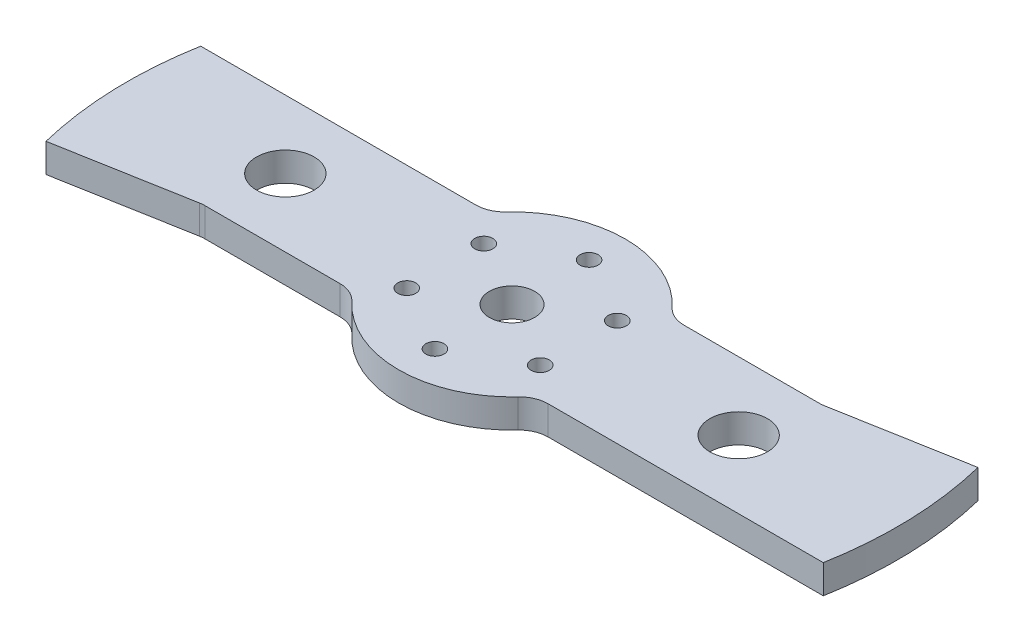
ISO-10303-21;
HEADER;
FILE_DESCRIPTION(('STEP AP214'),'2;1');
FILE_NAME('part.step','',(''),(''),'','','');
FILE_SCHEMA(('AUTOMOTIVE_DESIGN { 1 0 10303 214 1 1 1 1 }'));
ENDSEC;
DATA;
#1=APPLICATION_CONTEXT('core data for automotive mechanical design processes');
#2=APPLICATION_PROTOCOL_DEFINITION('international standard','automotive_design',2000,#1);
#3=PRODUCT_CONTEXT('',#1,'mechanical');
#4=PRODUCT('Part','Part','',(#3));
#5=PRODUCT_RELATED_PRODUCT_CATEGORY('part','',(#4));
#6=PRODUCT_DEFINITION_FORMATION('','',#4);
#7=PRODUCT_DEFINITION_CONTEXT('part definition',#1,'design');
#8=PRODUCT_DEFINITION('design','',#6,#7);
#9=PRODUCT_DEFINITION_SHAPE('','',#8);
#10=(LENGTH_UNIT() NAMED_UNIT(*) SI_UNIT(.MILLI.,.METRE.));
#11=(NAMED_UNIT(*) PLANE_ANGLE_UNIT() SI_UNIT($,.RADIAN.));
#12=(NAMED_UNIT(*) SI_UNIT($,.STERADIAN.) SOLID_ANGLE_UNIT());
#13=UNCERTAINTY_MEASURE_WITH_UNIT(LENGTH_MEASURE(1.E-05),#10,'distance_accuracy_value','');
#14=(GEOMETRIC_REPRESENTATION_CONTEXT(3) GLOBAL_UNCERTAINTY_ASSIGNED_CONTEXT((#13)) GLOBAL_UNIT_ASSIGNED_CONTEXT((#10,
#11,#12)) REPRESENTATION_CONTEXT('',''));
#15=CARTESIAN_POINT('',(0.,0.,0.));
#16=DIRECTION('',(0.,0.,1.));
#17=DIRECTION('',(1.,0.,0.));
#18=AXIS2_PLACEMENT_3D('',#15,#16,#17);
#19=CARTESIAN_POINT('',(0.,6.35,0.));
#20=DIRECTION('',(0.,-1.,0.));
#21=DIRECTION('',(0.,0.,-1.));
#22=AXIS2_PLACEMENT_3D('',#19,#20,#21);
#23=PLANE('',#22);
#24=CARTESIAN_POINT('',(-50.,6.35,0.));
#25=DIRECTION('',(0.,1.,0.));
#26=DIRECTION('',(0.,0.,1.));
#27=AXIS2_PLACEMENT_3D('',#24,#25,#26);
#28=CIRCLE('',#27,6.35);
#29=CARTESIAN_POINT('',(-50.,6.35,6.35000000000001));
#30=VERTEX_POINT('',#29);
#31=EDGE_CURVE('E574',#30,#30,#28,.T.);
#32=ORIENTED_EDGE('',*,*,#31,.F.);
#33=EDGE_LOOP('',(#32));
#34=FACE_BOUND('',#33,.T.);
#35=CARTESIAN_POINT('',(50.,6.35,0.));
#36=DIRECTION('',(0.,1.,0.));
#37=DIRECTION('',(0.,0.,1.));
#38=AXIS2_PLACEMENT_3D('',#35,#36,#37);
#39=CIRCLE('',#38,6.35);
#40=CARTESIAN_POINT('',(50.,6.35,6.35));
#41=VERTEX_POINT('',#40);
#42=EDGE_CURVE('E583',#41,#41,#39,.T.);
#43=ORIENTED_EDGE('',*,*,#42,.F.);
#44=EDGE_LOOP('',(#43));
#45=FACE_BOUND('',#44,.T.);
#46=CARTESIAN_POINT('',(0.,6.35,0.));
#47=DIRECTION('',(0.,1.,0.));
#48=DIRECTION('',(0.,0.,-1.));
#49=AXIS2_PLACEMENT_3D('',#46,#47,#48);
#50=CIRCLE('',#49,85.);
#51=CARTESIAN_POINT('',(-83.6660026534076,6.35,-15.));
#52=VERTEX_POINT('',#51);
#53=CARTESIAN_POINT('',(-82.5543913712341,6.35,20.2428373832601));
#54=VERTEX_POINT('',#53);
#55=EDGE_CURVE('E152',#52,#54,#50,.T.);
#56=ORIENTED_EDGE('',*,*,#55,.T.);
#57=DIRECTION('',(0.984305913569501,0.,-0.176470588235294));
#58=VECTOR('',#57,1.);
#59=CARTESIAN_POINT('',(-53.3112416099528,6.35,15.));
#60=LINE('',#59,#58);
#61=CARTESIAN_POINT('',(-53.8671043018561,6.35,15.0996574488337));
#62=VERTEX_POINT('',#61);
#63=EDGE_CURVE('E155',#54,#62,#60,.T.);
#64=ORIENTED_EDGE('',*,*,#63,.T.);
#65=CARTESIAN_POINT('',(-52.746516066562,6.35,21.35));
#66=DIRECTION('',(0.,-1.,0.));
#67=DIRECTION('',(0.,0.,-1.));
#68=AXIS2_PLACEMENT_3D('',#65,#66,#67);
#69=CIRCLE('',#68,6.35);
#70=CARTESIAN_POINT('',(-52.746516066562,6.35,15.));
#71=VERTEX_POINT('',#70);
#72=EDGE_CURVE('E11',#62,#71,#69,.T.);
#73=ORIENTED_EDGE('',*,*,#72,.T.);
#74=DIRECTION('',(1.,0.,0.));
#75=VECTOR('',#74,1.);
#76=CARTESIAN_POINT('',(-22.956480566498,6.35,15.));
#77=LINE('',#76,#75);
#78=CARTESIAN_POINT('',(-22.956480566498,6.35,15.));
#79=VERTEX_POINT('',#78);
#80=EDGE_CURVE('E175',#71,#79,#77,.T.);
#81=ORIENTED_EDGE('',*,*,#80,.T.);
#82=CARTESIAN_POINT('',(-22.956480566498,6.35,21.35));
#83=DIRECTION('',(0.,-1.,0.));
#84=DIRECTION('',(0.,0.,-1.));
#85=AXIS2_PLACEMENT_3D('',#82,#83,#84);
#86=CIRCLE('',#85,6.35);
#87=CARTESIAN_POINT('',(-18.3066033225662,6.35,17.0255183413078));
#88=VERTEX_POINT('',#87);
#89=EDGE_CURVE('E178',#79,#88,#86,.T.);
#90=ORIENTED_EDGE('',*,*,#89,.T.);
#91=CARTESIAN_POINT('',(0.,6.35,0.));
#92=DIRECTION('',(0.,1.,0.));
#93=DIRECTION('',(0.,0.,1.));
#94=AXIS2_PLACEMENT_3D('',#91,#92,#93);
#95=CIRCLE('',#94,25.);
#96=CARTESIAN_POINT('',(18.3066033225662,6.35,17.0255183413078));
#97=VERTEX_POINT('',#96);
#98=EDGE_CURVE('E184',#88,#97,#95,.T.);
#99=ORIENTED_EDGE('',*,*,#98,.T.);
#100=CARTESIAN_POINT('',(22.956480566498,6.35,21.35));
#101=DIRECTION('',(0.,-1.,0.));
#102=DIRECTION('',(0.,0.,-1.));
#103=AXIS2_PLACEMENT_3D('',#100,#101,#102);
#104=CIRCLE('',#103,6.35);
#105=CARTESIAN_POINT('',(22.956480566498,6.35,15.));
#106=VERTEX_POINT('',#105);
#107=EDGE_CURVE('E187',#97,#106,#104,.T.);
#108=ORIENTED_EDGE('',*,*,#107,.T.);
#109=DIRECTION('',(1.,0.,0.));
#110=VECTOR('',#109,1.);
#111=CARTESIAN_POINT('',(83.6660026534076,6.35,15.));
#112=LINE('',#111,#110);
#113=CARTESIAN_POINT('',(83.6660026534076,6.35,15.));
#114=VERTEX_POINT('',#113);
#115=EDGE_CURVE('E190',#106,#114,#112,.T.);
#116=ORIENTED_EDGE('',*,*,#115,.T.);
#117=CARTESIAN_POINT('',(0.,6.35,0.));
#118=DIRECTION('',(0.,1.,0.));
#119=DIRECTION('',(0.,0.,1.));
#120=AXIS2_PLACEMENT_3D('',#117,#118,#119);
#121=CIRCLE('',#120,85.);
#122=CARTESIAN_POINT('',(82.5543913712341,6.35,-20.2428373832601));
#123=VERTEX_POINT('',#122);
#124=EDGE_CURVE('E193',#114,#123,#121,.T.);
#125=ORIENTED_EDGE('',*,*,#124,.T.);
#126=DIRECTION('',(-0.984305913569501,0.,0.176470588235294));
#127=VECTOR('',#126,1.);
#128=CARTESIAN_POINT('',(53.3112416099528,6.35,-15.));
#129=LINE('',#128,#127);
#130=CARTESIAN_POINT('',(53.8671043018561,6.35,-15.0996574488337));
#131=VERTEX_POINT('',#130);
#132=EDGE_CURVE('E196',#123,#131,#129,.T.);
#133=ORIENTED_EDGE('',*,*,#132,.T.);
#134=CARTESIAN_POINT('',(52.746516066562,6.35,-21.35));
#135=DIRECTION('',(0.,-1.,0.));
#136=DIRECTION('',(0.,0.,-1.));
#137=AXIS2_PLACEMENT_3D('',#134,#135,#136);
#138=CIRCLE('',#137,6.35);
#139=CARTESIAN_POINT('',(52.746516066562,6.35,-15.));
#140=VERTEX_POINT('',#139);
#141=EDGE_CURVE('E315',#131,#140,#138,.T.);
#142=ORIENTED_EDGE('',*,*,#141,.T.);
#143=DIRECTION('',(-1.,0.,0.));
#144=VECTOR('',#143,1.);
#145=CARTESIAN_POINT('',(53.3112416099528,6.35,-15.));
#146=LINE('',#145,#144);
#147=CARTESIAN_POINT('',(22.956480566498,6.35,-15.));
#148=VERTEX_POINT('',#147);
#149=EDGE_CURVE('E200',#140,#148,#146,.T.);
#150=ORIENTED_EDGE('',*,*,#149,.T.);
#151=CARTESIAN_POINT('',(22.956480566498,6.35,-21.35));
#152=DIRECTION('',(0.,-1.,0.));
#153=DIRECTION('',(0.,0.,-1.));
#154=AXIS2_PLACEMENT_3D('',#151,#152,#153);
#155=CIRCLE('',#154,6.35);
#156=CARTESIAN_POINT('',(18.3066033225662,6.35,-17.0255183413078));
#157=VERTEX_POINT('',#156);
#158=EDGE_CURVE('E203',#148,#157,#155,.T.);
#159=ORIENTED_EDGE('',*,*,#158,.T.);
#160=CARTESIAN_POINT('',(0.,6.35,0.));
#161=DIRECTION('',(0.,1.,0.));
#162=DIRECTION('',(0.,0.,1.));
#163=AXIS2_PLACEMENT_3D('',#160,#161,#162);
#164=CIRCLE('',#163,25.);
#165=CARTESIAN_POINT('',(-18.3066033225662,6.35,-17.0255183413078));
#166=VERTEX_POINT('',#165);
#167=EDGE_CURVE('E206',#157,#166,#164,.T.);
#168=ORIENTED_EDGE('',*,*,#167,.T.);
#169=CARTESIAN_POINT('',(-22.956480566498,6.35,-21.35));
#170=DIRECTION('',(0.,-1.,0.));
#171=DIRECTION('',(0.,0.,-1.));
#172=AXIS2_PLACEMENT_3D('',#169,#170,#171);
#173=CIRCLE('',#172,6.35);
#174=CARTESIAN_POINT('',(-22.956480566498,6.35,-15.));
#175=VERTEX_POINT('',#174);
#176=EDGE_CURVE('E209',#166,#175,#173,.T.);
#177=ORIENTED_EDGE('',*,*,#176,.T.);
#178=DIRECTION('',(-1.,0.,0.));
#179=VECTOR('',#178,1.);
#180=CARTESIAN_POINT('',(-22.956480566498,6.35,-15.));
#181=LINE('',#180,#179);
#182=EDGE_CURVE('E158',#175,#52,#181,.T.);
#183=ORIENTED_EDGE('',*,*,#182,.T.);
#184=EDGE_LOOP('',(#56,#64,#73,#81,#90,#99,#108,#116,#125,#133,#142,#150,#159,#168,#177,#183));
#185=FACE_BOUND('',#184,.T.);
#186=CARTESIAN_POINT('',(0.,6.35,0.));
#187=DIRECTION('',(0.,1.,0.));
#188=DIRECTION('',(0.,0.,1.));
#189=AXIS2_PLACEMENT_3D('',#186,#187,#188);
#190=CIRCLE('',#189,5.);
#191=CARTESIAN_POINT('',(0.,6.35,5.));
#192=VERTEX_POINT('',#191);
#193=EDGE_CURVE('E218',#192,#192,#190,.T.);
#194=ORIENTED_EDGE('',*,*,#193,.F.);
#195=EDGE_LOOP('',(#194));
#196=FACE_BOUND('',#195,.T.);
#197=CARTESIAN_POINT('',(0.,6.35,-17.));
#198=DIRECTION('',(0.,1.,0.));
#199=DIRECTION('',(0.,0.,1.));
#200=AXIS2_PLACEMENT_3D('',#197,#198,#199);
#201=CIRCLE('',#200,2.00000000000001);
#202=CARTESIAN_POINT('',(0.,6.35,-15.));
#203=VERTEX_POINT('',#202);
#204=EDGE_CURVE('E629',#203,#203,#201,.T.);
#205=ORIENTED_EDGE('',*,*,#204,.F.);
#206=EDGE_LOOP('',(#205));
#207=FACE_BOUND('',#206,.T.);
#208=CARTESIAN_POINT('',(14.7224318643355,6.35,-8.49999999999996));
#209=DIRECTION('',(0.,1.,0.));
#210=DIRECTION('',(0.,0.,1.));
#211=AXIS2_PLACEMENT_3D('',#208,#209,#210);
#212=CIRCLE('',#211,2.);
#213=CARTESIAN_POINT('',(14.7224318643355,6.35,-6.49999999999996));
#214=VERTEX_POINT('',#213);
#215=EDGE_CURVE('E621',#214,#214,#212,.T.);
#216=ORIENTED_EDGE('',*,*,#215,.F.);
#217=EDGE_LOOP('',(#216));
#218=FACE_BOUND('',#217,.T.);
#219=CARTESIAN_POINT('',(14.7224318643355,6.35,8.49999999999999));
#220=DIRECTION('',(0.,1.,0.));
#221=DIRECTION('',(0.,0.,1.));
#222=AXIS2_PLACEMENT_3D('',#219,#220,#221);
#223=CIRCLE('',#222,2.00000000000009);
#224=CARTESIAN_POINT('',(14.7224318643355,6.35,10.5000000000001));
#225=VERTEX_POINT('',#224);
#226=EDGE_CURVE('E613',#225,#225,#223,.T.);
#227=ORIENTED_EDGE('',*,*,#226,.F.);
#228=EDGE_LOOP('',(#227));
#229=FACE_BOUND('',#228,.T.);
#230=CARTESIAN_POINT('',(0.,6.35,17.));
#231=DIRECTION('',(0.,1.,0.));
#232=DIRECTION('',(0.,0.,1.));
#233=AXIS2_PLACEMENT_3D('',#230,#231,#232);
#234=CIRCLE('',#233,2.00000000000013);
#235=CARTESIAN_POINT('',(0.,6.35,19.0000000000001));
#236=VERTEX_POINT('',#235);
#237=EDGE_CURVE('E605',#236,#236,#234,.T.);
#238=ORIENTED_EDGE('',*,*,#237,.F.);
#239=EDGE_LOOP('',(#238));
#240=FACE_BOUND('',#239,.T.);
#241=CARTESIAN_POINT('',(-14.7224318643355,6.35,8.50000000000001));
#242=DIRECTION('',(0.,1.,0.));
#243=DIRECTION('',(0.,0.,1.));
#244=AXIS2_PLACEMENT_3D('',#241,#242,#243);
#245=CIRCLE('',#244,2.00000000000017);
#246=CARTESIAN_POINT('',(-14.7224318643355,6.35,10.5000000000002));
#247=VERTEX_POINT('',#246);
#248=EDGE_CURVE('E597',#247,#247,#245,.T.);
#249=ORIENTED_EDGE('',*,*,#248,.F.);
#250=EDGE_LOOP('',(#249));
#251=FACE_BOUND('',#250,.T.);
#252=CARTESIAN_POINT('',(-14.7224318643354,6.35,-8.50000000000018));
#253=DIRECTION('',(0.,1.,0.));
#254=DIRECTION('',(0.,0.,1.));
#255=AXIS2_PLACEMENT_3D('',#252,#253,#254);
#256=CIRCLE('',#255,2.);
#257=CARTESIAN_POINT('',(-14.7224318643354,6.35,-6.50000000000017));
#258=VERTEX_POINT('',#257);
#259=EDGE_CURVE('E589',#258,#258,#256,.T.);
#260=ORIENTED_EDGE('',*,*,#259,.F.);
#261=EDGE_LOOP('',(#260));
#262=FACE_BOUND('',#261,.T.);
#263=ADVANCED_FACE('F39',(#34,#45,#185,#196,#207,#218,#229,#240,#251,#262),#23,.F.);
#264=CARTESIAN_POINT('',(0.,0.,0.));
#265=DIRECTION('',(0.,-1.,0.));
#266=DIRECTION('',(0.,0.,-1.));
#267=AXIS2_PLACEMENT_3D('',#264,#265,#266);
#268=PLANE('',#267);
#269=CARTESIAN_POINT('',(-50.,0.,0.));
#270=DIRECTION('',(0.,1.,0.));
#271=DIRECTION('',(0.,0.,1.));
#272=AXIS2_PLACEMENT_3D('',#269,#270,#271);
#273=CIRCLE('',#272,6.35);
#274=CARTESIAN_POINT('',(-50.,0.,6.35000000000001));
#275=VERTEX_POINT('',#274);
#276=EDGE_CURVE('E572',#275,#275,#273,.T.);
#277=ORIENTED_EDGE('',*,*,#276,.T.);
#278=EDGE_LOOP('',(#277));
#279=FACE_BOUND('',#278,.T.);
#280=CARTESIAN_POINT('',(50.,0.,0.));
#281=DIRECTION('',(0.,1.,0.));
#282=DIRECTION('',(0.,0.,1.));
#283=AXIS2_PLACEMENT_3D('',#280,#281,#282);
#284=CIRCLE('',#283,6.35);
#285=CARTESIAN_POINT('',(50.,0.,6.35));
#286=VERTEX_POINT('',#285);
#287=EDGE_CURVE('E576',#286,#286,#284,.T.);
#288=ORIENTED_EDGE('',*,*,#287,.T.);
#289=EDGE_LOOP('',(#288));
#290=FACE_BOUND('',#289,.T.);
#291=CARTESIAN_POINT('',(-14.7224318643355,0.,8.50000000000001));
#292=DIRECTION('',(0.,1.,0.));
#293=DIRECTION('',(0.,0.,1.));
#294=AXIS2_PLACEMENT_3D('',#291,#292,#293);
#295=CIRCLE('',#294,2.00000000000017);
#296=CARTESIAN_POINT('',(-14.7224318643355,0.,10.5000000000002));
#297=VERTEX_POINT('',#296);
#298=EDGE_CURVE('E593',#297,#297,#295,.T.);
#299=ORIENTED_EDGE('',*,*,#298,.T.);
#300=EDGE_LOOP('',(#299));
#301=FACE_BOUND('',#300,.T.);
#302=CARTESIAN_POINT('',(14.7224318643355,0.,8.49999999999999));
#303=DIRECTION('',(0.,1.,0.));
#304=DIRECTION('',(0.,0.,1.));
#305=AXIS2_PLACEMENT_3D('',#302,#303,#304);
#306=CIRCLE('',#305,2.00000000000009);
#307=CARTESIAN_POINT('',(14.7224318643355,0.,10.5000000000001));
#308=VERTEX_POINT('',#307);
#309=EDGE_CURVE('E609',#308,#308,#306,.T.);
#310=ORIENTED_EDGE('',*,*,#309,.T.);
#311=EDGE_LOOP('',(#310));
#312=FACE_BOUND('',#311,.T.);
#313=CARTESIAN_POINT('',(0.,0.,-17.));
#314=DIRECTION('',(0.,1.,0.));
#315=DIRECTION('',(0.,0.,1.));
#316=AXIS2_PLACEMENT_3D('',#313,#314,#315);
#317=CIRCLE('',#316,2.00000000000001);
#318=CARTESIAN_POINT('',(0.,0.,-15.));
#319=VERTEX_POINT('',#318);
#320=EDGE_CURVE('E625',#319,#319,#317,.T.);
#321=ORIENTED_EDGE('',*,*,#320,.T.);
#322=EDGE_LOOP('',(#321));
#323=FACE_BOUND('',#322,.T.);
#324=CARTESIAN_POINT('',(0.,0.,0.));
#325=DIRECTION('',(0.,1.,0.));
#326=DIRECTION('',(0.,0.,1.));
#327=AXIS2_PLACEMENT_3D('',#324,#325,#326);
#328=CIRCLE('',#327,85.);
#329=CARTESIAN_POINT('',(-83.6660026534076,0.,-15.));
#330=VERTEX_POINT('',#329);
#331=CARTESIAN_POINT('',(-82.5543913712341,0.,20.2428373832601));
#332=VERTEX_POINT('',#331);
#333=EDGE_CURVE('E168',#330,#332,#328,.T.);
#334=ORIENTED_EDGE('',*,*,#333,.F.);
#335=DIRECTION('',(-1.,0.,0.));
#336=VECTOR('',#335,1.);
#337=CARTESIAN_POINT('',(-22.956480566498,0.,-15.));
#338=LINE('',#337,#336);
#339=CARTESIAN_POINT('',(-22.956480566498,0.,-15.));
#340=VERTEX_POINT('',#339);
#341=EDGE_CURVE('E163',#340,#330,#338,.T.);
#342=ORIENTED_EDGE('',*,*,#341,.F.);
#343=CARTESIAN_POINT('',(-22.956480566498,0.,-21.35));
#344=DIRECTION('',(0.,-1.,0.));
#345=DIRECTION('',(0.,0.,-1.));
#346=AXIS2_PLACEMENT_3D('',#343,#344,#345);
#347=CIRCLE('',#346,6.35);
#348=CARTESIAN_POINT('',(-18.3066033225662,0.,-17.0255183413078));
#349=VERTEX_POINT('',#348);
#350=EDGE_CURVE('E253',#349,#340,#347,.T.);
#351=ORIENTED_EDGE('',*,*,#350,.F.);
#352=CARTESIAN_POINT('',(0.,0.,0.));
#353=DIRECTION('',(0.,1.,0.));
#354=DIRECTION('',(0.,0.,1.));
#355=AXIS2_PLACEMENT_3D('',#352,#353,#354);
#356=CIRCLE('',#355,25.);
#357=CARTESIAN_POINT('',(18.3066033225662,0.,-17.0255183413078));
#358=VERTEX_POINT('',#357);
#359=EDGE_CURVE('E250',#358,#349,#356,.T.);
#360=ORIENTED_EDGE('',*,*,#359,.F.);
#361=CARTESIAN_POINT('',(22.956480566498,0.,-21.35));
#362=DIRECTION('',(0.,-1.,0.));
#363=DIRECTION('',(0.,0.,-1.));
#364=AXIS2_PLACEMENT_3D('',#361,#362,#363);
#365=CIRCLE('',#364,6.35);
#366=CARTESIAN_POINT('',(22.956480566498,0.,-15.));
#367=VERTEX_POINT('',#366);
#368=EDGE_CURVE('E247',#367,#358,#365,.T.);
#369=ORIENTED_EDGE('',*,*,#368,.F.);
#370=DIRECTION('',(-1.,0.,0.));
#371=VECTOR('',#370,1.);
#372=CARTESIAN_POINT('',(53.3112416099528,0.,-15.));
#373=LINE('',#372,#371);
#374=CARTESIAN_POINT('',(52.746516066562,0.,-15.));
#375=VERTEX_POINT('',#374);
#376=EDGE_CURVE('E244',#375,#367,#373,.T.);
#377=ORIENTED_EDGE('',*,*,#376,.F.);
#378=CARTESIAN_POINT('',(52.746516066562,0.,-21.35));
#379=DIRECTION('',(0.,-1.,0.));
#380=DIRECTION('',(0.,0.,-1.));
#381=AXIS2_PLACEMENT_3D('',#378,#379,#380);
#382=CIRCLE('',#381,6.35);
#383=CARTESIAN_POINT('',(53.8671043018561,0.,-15.0996574488337));
#384=VERTEX_POINT('',#383);
#385=EDGE_CURVE('E312',#375,#384,#382,.F.);
#386=ORIENTED_EDGE('',*,*,#385,.T.);
#387=DIRECTION('',(-0.984305913569501,0.,0.176470588235294));
#388=VECTOR('',#387,1.);
#389=CARTESIAN_POINT('',(53.3112416099528,0.,-15.));
#390=LINE('',#389,#388);
#391=CARTESIAN_POINT('',(82.5543913712341,0.,-20.2428373832601));
#392=VERTEX_POINT('',#391);
#393=EDGE_CURVE('E240',#392,#384,#390,.T.);
#394=ORIENTED_EDGE('',*,*,#393,.F.);
#395=CARTESIAN_POINT('',(0.,0.,0.));
#396=DIRECTION('',(0.,1.,0.));
#397=DIRECTION('',(0.,0.,-1.));
#398=AXIS2_PLACEMENT_3D('',#395,#396,#397);
#399=CIRCLE('',#398,85.);
#400=CARTESIAN_POINT('',(83.6660026534076,0.,15.));
#401=VERTEX_POINT('',#400);
#402=EDGE_CURVE('E237',#401,#392,#399,.T.);
#403=ORIENTED_EDGE('',*,*,#402,.F.);
#404=DIRECTION('',(1.,0.,0.));
#405=VECTOR('',#404,1.);
#406=CARTESIAN_POINT('',(83.6660026534076,0.,15.));
#407=LINE('',#406,#405);
#408=CARTESIAN_POINT('',(22.956480566498,0.,15.));
#409=VERTEX_POINT('',#408);
#410=EDGE_CURVE('E233',#409,#401,#407,.T.);
#411=ORIENTED_EDGE('',*,*,#410,.F.);
#412=CARTESIAN_POINT('',(22.956480566498,0.,21.35));
#413=DIRECTION('',(0.,-1.,0.));
#414=DIRECTION('',(0.,0.,-1.));
#415=AXIS2_PLACEMENT_3D('',#412,#413,#414);
#416=CIRCLE('',#415,6.35);
#417=CARTESIAN_POINT('',(18.3066033225662,0.,17.0255183413078));
#418=VERTEX_POINT('',#417);
#419=EDGE_CURVE('E230',#418,#409,#416,.T.);
#420=ORIENTED_EDGE('',*,*,#419,.F.);
#421=CARTESIAN_POINT('',(0.,0.,0.));
#422=DIRECTION('',(0.,1.,0.));
#423=DIRECTION('',(0.,0.,1.));
#424=AXIS2_PLACEMENT_3D('',#421,#422,#423);
#425=CIRCLE('',#424,25.);
#426=CARTESIAN_POINT('',(-18.3066033225662,0.,17.0255183413078));
#427=VERTEX_POINT('',#426);
#428=EDGE_CURVE('E227',#427,#418,#425,.T.);
#429=ORIENTED_EDGE('',*,*,#428,.F.);
#430=CARTESIAN_POINT('',(-22.956480566498,0.,21.35));
#431=DIRECTION('',(0.,-1.,0.));
#432=DIRECTION('',(0.,0.,-1.));
#433=AXIS2_PLACEMENT_3D('',#430,#431,#432);
#434=CIRCLE('',#433,6.35);
#435=CARTESIAN_POINT('',(-22.956480566498,0.,15.));
#436=VERTEX_POINT('',#435);
#437=EDGE_CURVE('E224',#436,#427,#434,.T.);
#438=ORIENTED_EDGE('',*,*,#437,.F.);
#439=DIRECTION('',(1.,0.,0.));
#440=VECTOR('',#439,1.);
#441=CARTESIAN_POINT('',(-22.956480566498,0.,15.));
#442=LINE('',#441,#440);
#443=CARTESIAN_POINT('',(-52.746516066562,0.,15.));
#444=VERTEX_POINT('',#443);
#445=EDGE_CURVE('E221',#444,#436,#442,.T.);
#446=ORIENTED_EDGE('',*,*,#445,.F.);
#447=CARTESIAN_POINT('',(-52.746516066562,0.,21.35));
#448=DIRECTION('',(0.,-1.,0.));
#449=DIRECTION('',(0.,0.,-1.));
#450=AXIS2_PLACEMENT_3D('',#447,#448,#449);
#451=CIRCLE('',#450,6.35);
#452=CARTESIAN_POINT('',(-53.8671043018561,0.,15.0996574488337));
#453=VERTEX_POINT('',#452);
#454=EDGE_CURVE('E48',#444,#453,#451,.F.);
#455=ORIENTED_EDGE('',*,*,#454,.T.);
#456=DIRECTION('',(0.984305913569501,0.,-0.176470588235294));
#457=VECTOR('',#456,1.);
#458=CARTESIAN_POINT('',(-53.3112416099528,0.,15.));
#459=LINE('',#458,#457);
#460=EDGE_CURVE('E217',#332,#453,#459,.T.);
#461=ORIENTED_EDGE('',*,*,#460,.F.);
#462=EDGE_LOOP('',(#334,#342,#351,#360,#369,#377,#386,#394,#403,#411,#420,#429,#438,#446,#455,#461));
#463=FACE_BOUND('',#462,.T.);
#464=CARTESIAN_POINT('',(0.,0.,0.));
#465=DIRECTION('',(0.,1.,0.));
#466=DIRECTION('',(0.,0.,1.));
#467=AXIS2_PLACEMENT_3D('',#464,#465,#466);
#468=CIRCLE('',#467,5.);
#469=CARTESIAN_POINT('',(0.,0.,5.));
#470=VERTEX_POINT('',#469);
#471=EDGE_CURVE('E633',#470,#470,#468,.T.);
#472=ORIENTED_EDGE('',*,*,#471,.T.);
#473=EDGE_LOOP('',(#472));
#474=FACE_BOUND('',#473,.T.);
#475=CARTESIAN_POINT('',(14.7224318643355,0.,-8.49999999999996));
#476=DIRECTION('',(0.,1.,0.));
#477=DIRECTION('',(0.,0.,1.));
#478=AXIS2_PLACEMENT_3D('',#475,#476,#477);
#479=CIRCLE('',#478,2.);
#480=CARTESIAN_POINT('',(14.7224318643355,0.,-6.49999999999996));
#481=VERTEX_POINT('',#480);
#482=EDGE_CURVE('E617',#481,#481,#479,.T.);
#483=ORIENTED_EDGE('',*,*,#482,.T.);
#484=EDGE_LOOP('',(#483));
#485=FACE_BOUND('',#484,.T.);
#486=CARTESIAN_POINT('',(0.,0.,17.));
#487=DIRECTION('',(0.,1.,0.));
#488=DIRECTION('',(0.,0.,1.));
#489=AXIS2_PLACEMENT_3D('',#486,#487,#488);
#490=CIRCLE('',#489,2.00000000000013);
#491=CARTESIAN_POINT('',(0.,0.,19.0000000000001));
#492=VERTEX_POINT('',#491);
#493=EDGE_CURVE('E601',#492,#492,#490,.T.);
#494=ORIENTED_EDGE('',*,*,#493,.T.);
#495=EDGE_LOOP('',(#494));
#496=FACE_BOUND('',#495,.T.);
#497=CARTESIAN_POINT('',(-14.7224318643354,0.,-8.50000000000018));
#498=DIRECTION('',(0.,1.,0.));
#499=DIRECTION('',(0.,0.,1.));
#500=AXIS2_PLACEMENT_3D('',#497,#498,#499);
#501=CIRCLE('',#500,2.);
#502=CARTESIAN_POINT('',(-14.7224318643354,0.,-6.50000000000017));
#503=VERTEX_POINT('',#502);
#504=EDGE_CURVE('E580',#503,#503,#501,.T.);
#505=ORIENTED_EDGE('',*,*,#504,.T.);
#506=EDGE_LOOP('',(#505));
#507=FACE_BOUND('',#506,.T.);
#508=ADVANCED_FACE('F331',(#279,#290,#301,#312,#323,#463,#474,#485,#496,#507),#268,.T.);
#509=CARTESIAN_POINT('',(0.,6.35,0.));
#510=DIRECTION('',(0.,-1.,0.));
#511=DIRECTION('',(0.,0.,-1.));
#512=AXIS2_PLACEMENT_3D('',#509,#510,#511);
#513=CYLINDRICAL_SURFACE('',#512,85.);
#514=ORIENTED_EDGE('',*,*,#333,.T.);
#515=DIRECTION('',(0.,-1.,0.));
#516=VECTOR('',#515,1.);
#517=CARTESIAN_POINT('',(-82.5543913712341,6.35,20.2428373832601));
#518=LINE('',#517,#516);
#519=EDGE_CURVE('E166',#54,#332,#518,.T.);
#520=ORIENTED_EDGE('',*,*,#519,.F.);
#521=ORIENTED_EDGE('',*,*,#55,.F.);
#522=DIRECTION('',(0.,-1.,0.));
#523=VECTOR('',#522,1.);
#524=CARTESIAN_POINT('',(-83.6660026534076,6.35,-15.));
#525=LINE('',#524,#523);
#526=EDGE_CURVE('E214',#52,#330,#525,.T.);
#527=ORIENTED_EDGE('',*,*,#526,.T.);
#528=EDGE_LOOP('',(#514,#520,#521,#527));
#529=FACE_BOUND('',#528,.T.);
#530=ADVANCED_FACE('F167',(#529),#513,.T.);
#531=CARTESIAN_POINT('',(-53.3112416099528,6.35,15.));
#532=DIRECTION('',(-0.176470588235294,0.,-0.984305913569501));
#533=DIRECTION('',(-0.984305913569501,0.,0.176470588235294));
#534=AXIS2_PLACEMENT_3D('',#531,#532,#533);
#535=PLANE('',#534);
#536=ORIENTED_EDGE('',*,*,#460,.T.);
#537=DIRECTION('',(0.,-1.,0.));
#538=VECTOR('',#537,1.);
#539=CARTESIAN_POINT('',(-53.8671043018561,6.35,15.0996574488337));
#540=LINE('',#539,#538);
#541=EDGE_CURVE('E55',#453,#62,#540,.F.);
#542=ORIENTED_EDGE('',*,*,#541,.T.);
#543=ORIENTED_EDGE('',*,*,#63,.F.);
#544=ORIENTED_EDGE('',*,*,#519,.T.);
#545=EDGE_LOOP('',(#536,#542,#543,#544));
#546=FACE_BOUND('',#545,.T.);
#547=ADVANCED_FACE('F173',(#546),#535,.F.);
#548=CARTESIAN_POINT('',(-22.956480566498,6.35,15.));
#549=DIRECTION('',(0.,0.,-1.));
#550=DIRECTION('',(-1.,0.,0.));
#551=AXIS2_PLACEMENT_3D('',#548,#549,#550);
#552=PLANE('',#551);
#553=ORIENTED_EDGE('',*,*,#80,.F.);
#554=DIRECTION('',(0.,-1.,0.));
#555=VECTOR('',#554,1.);
#556=CARTESIAN_POINT('',(-52.746516066562,0.,15.));
#557=LINE('',#556,#555);
#558=EDGE_CURVE('E306',#71,#444,#557,.T.);
#559=ORIENTED_EDGE('',*,*,#558,.T.);
#560=ORIENTED_EDGE('',*,*,#445,.T.);
#561=DIRECTION('',(0.,-1.,0.));
#562=VECTOR('',#561,1.);
#563=CARTESIAN_POINT('',(-22.956480566498,6.35,15.));
#564=LINE('',#563,#562);
#565=EDGE_CURVE('E171',#79,#436,#564,.T.);
#566=ORIENTED_EDGE('',*,*,#565,.F.);
#567=EDGE_LOOP('',(#553,#559,#560,#566));
#568=FACE_BOUND('',#567,.T.);
#569=ADVANCED_FACE('F363',(#568),#552,.F.);
#570=CARTESIAN_POINT('',(-22.956480566498,6.35,21.35));
#571=DIRECTION('',(0.,-1.,0.));
#572=DIRECTION('',(0.,0.,-1.));
#573=AXIS2_PLACEMENT_3D('',#570,#571,#572);
#574=CYLINDRICAL_SURFACE('',#573,6.35);
#575=ORIENTED_EDGE('',*,*,#437,.T.);
#576=DIRECTION('',(0.,-1.,0.));
#577=VECTOR('',#576,1.);
#578=CARTESIAN_POINT('',(-18.3066033225662,6.35,17.0255183413078));
#579=LINE('',#578,#577);
#580=EDGE_CURVE('E293',#88,#427,#579,.T.);
#581=ORIENTED_EDGE('',*,*,#580,.F.);
#582=ORIENTED_EDGE('',*,*,#89,.F.);
#583=ORIENTED_EDGE('',*,*,#565,.T.);
#584=EDGE_LOOP('',(#575,#581,#582,#583));
#585=FACE_BOUND('',#584,.T.);
#586=ADVANCED_FACE('F359',(#585),#574,.F.);
#587=CARTESIAN_POINT('',(0.,6.35,0.));
#588=DIRECTION('',(0.,-1.,0.));
#589=DIRECTION('',(0.,0.,-1.));
#590=AXIS2_PLACEMENT_3D('',#587,#588,#589);
#591=CYLINDRICAL_SURFACE('',#590,25.);
#592=ORIENTED_EDGE('',*,*,#428,.T.);
#593=DIRECTION('',(0.,-1.,0.));
#594=VECTOR('',#593,1.);
#595=CARTESIAN_POINT('',(18.3066033225662,6.35,17.0255183413078));
#596=LINE('',#595,#594);
#597=EDGE_CURVE('E289',#97,#418,#596,.T.);
#598=ORIENTED_EDGE('',*,*,#597,.F.);
#599=ORIENTED_EDGE('',*,*,#98,.F.);
#600=ORIENTED_EDGE('',*,*,#580,.T.);
#601=EDGE_LOOP('',(#592,#598,#599,#600));
#602=FACE_BOUND('',#601,.T.);
#603=ADVANCED_FACE('F354',(#602),#591,.T.);
#604=CARTESIAN_POINT('',(22.956480566498,6.35,21.35));
#605=DIRECTION('',(0.,-1.,0.));
#606=DIRECTION('',(0.,0.,-1.));
#607=AXIS2_PLACEMENT_3D('',#604,#605,#606);
#608=CYLINDRICAL_SURFACE('',#607,6.35);
#609=ORIENTED_EDGE('',*,*,#419,.T.);
#610=DIRECTION('',(0.,-1.,0.));
#611=VECTOR('',#610,1.);
#612=CARTESIAN_POINT('',(22.956480566498,6.35,15.));
#613=LINE('',#612,#611);
#614=EDGE_CURVE('E285',#106,#409,#613,.T.);
#615=ORIENTED_EDGE('',*,*,#614,.F.);
#616=ORIENTED_EDGE('',*,*,#107,.F.);
#617=ORIENTED_EDGE('',*,*,#597,.T.);
#618=EDGE_LOOP('',(#609,#615,#616,#617));
#619=FACE_BOUND('',#618,.T.);
#620=ADVANCED_FACE('F349',(#619),#608,.F.);
#621=CARTESIAN_POINT('',(83.6660026534076,6.35,15.));
#622=DIRECTION('',(0.,0.,-1.));
#623=DIRECTION('',(-1.,0.,0.));
#624=AXIS2_PLACEMENT_3D('',#621,#622,#623);
#625=PLANE('',#624);
#626=ORIENTED_EDGE('',*,*,#410,.T.);
#627=DIRECTION('',(0.,-1.,0.));
#628=VECTOR('',#627,1.);
#629=CARTESIAN_POINT('',(83.6660026534076,6.35,15.));
#630=LINE('',#629,#628);
#631=EDGE_CURVE('E281',#114,#401,#630,.T.);
#632=ORIENTED_EDGE('',*,*,#631,.F.);
#633=ORIENTED_EDGE('',*,*,#115,.F.);
#634=ORIENTED_EDGE('',*,*,#614,.T.);
#635=EDGE_LOOP('',(#626,#632,#633,#634));
#636=FACE_BOUND('',#635,.T.);
#637=ADVANCED_FACE('F344',(#636),#625,.F.);
#638=CARTESIAN_POINT('',(0.,6.35,0.));
#639=DIRECTION('',(0.,-1.,0.));
#640=DIRECTION('',(0.,0.,-1.));
#641=AXIS2_PLACEMENT_3D('',#638,#639,#640);
#642=CYLINDRICAL_SURFACE('',#641,85.);
#643=ORIENTED_EDGE('',*,*,#402,.T.);
#644=DIRECTION('',(0.,-1.,0.));
#645=VECTOR('',#644,1.);
#646=CARTESIAN_POINT('',(82.5543913712341,6.35,-20.2428373832601));
#647=LINE('',#646,#645);
#648=EDGE_CURVE('E277',#123,#392,#647,.T.);
#649=ORIENTED_EDGE('',*,*,#648,.F.);
#650=ORIENTED_EDGE('',*,*,#124,.F.);
#651=ORIENTED_EDGE('',*,*,#631,.T.);
#652=EDGE_LOOP('',(#643,#649,#650,#651));
#653=FACE_BOUND('',#652,.T.);
#654=ADVANCED_FACE('F339',(#653),#642,.T.);
#655=CARTESIAN_POINT('',(53.3112416099528,6.35,-15.));
#656=DIRECTION('',(0.176470588235294,0.,0.984305913569501));
#657=DIRECTION('',(0.984305913569501,0.,-0.176470588235294));
#658=AXIS2_PLACEMENT_3D('',#655,#656,#657);
#659=PLANE('',#658);
#660=ORIENTED_EDGE('',*,*,#393,.T.);
#661=DIRECTION('',(0.,-1.,0.));
#662=VECTOR('',#661,1.);
#663=CARTESIAN_POINT('',(53.8671043018561,6.35,-15.0996574488337));
#664=LINE('',#663,#662);
#665=EDGE_CURVE('E303',#384,#131,#664,.F.);
#666=ORIENTED_EDGE('',*,*,#665,.T.);
#667=ORIENTED_EDGE('',*,*,#132,.F.);
#668=ORIENTED_EDGE('',*,*,#648,.T.);
#669=EDGE_LOOP('',(#660,#666,#667,#668));
#670=FACE_BOUND('',#669,.T.);
#671=ADVANCED_FACE('F335',(#670),#659,.F.);
#672=CARTESIAN_POINT('',(53.3112416099528,6.35,-15.));
#673=DIRECTION('',(0.,0.,1.));
#674=DIRECTION('',(1.,0.,0.));
#675=AXIS2_PLACEMENT_3D('',#672,#673,#674);
#676=PLANE('',#675);
#677=ORIENTED_EDGE('',*,*,#149,.F.);
#678=DIRECTION('',(0.,-1.,0.));
#679=VECTOR('',#678,1.);
#680=CARTESIAN_POINT('',(52.746516066562,0.,-15.));
#681=LINE('',#680,#679);
#682=EDGE_CURVE('E170',#140,#375,#681,.T.);
#683=ORIENTED_EDGE('',*,*,#682,.T.);
#684=ORIENTED_EDGE('',*,*,#376,.T.);
#685=DIRECTION('',(0.,-1.,0.));
#686=VECTOR('',#685,1.);
#687=CARTESIAN_POINT('',(22.956480566498,6.35,-15.));
#688=LINE('',#687,#686);
#689=EDGE_CURVE('E273',#148,#367,#688,.T.);
#690=ORIENTED_EDGE('',*,*,#689,.F.);
#691=EDGE_LOOP('',(#677,#683,#684,#690));
#692=FACE_BOUND('',#691,.T.);
#693=ADVANCED_FACE('F326',(#692),#676,.F.);
#694=CARTESIAN_POINT('',(22.956480566498,6.35,-21.35));
#695=DIRECTION('',(0.,-1.,0.));
#696=DIRECTION('',(0.,0.,-1.));
#697=AXIS2_PLACEMENT_3D('',#694,#695,#696);
#698=CYLINDRICAL_SURFACE('',#697,6.35);
#699=ORIENTED_EDGE('',*,*,#368,.T.);
#700=DIRECTION('',(0.,-1.,0.));
#701=VECTOR('',#700,1.);
#702=CARTESIAN_POINT('',(18.3066033225662,6.35,-17.0255183413078));
#703=LINE('',#702,#701);
#704=EDGE_CURVE('E269',#157,#358,#703,.T.);
#705=ORIENTED_EDGE('',*,*,#704,.F.);
#706=ORIENTED_EDGE('',*,*,#158,.F.);
#707=ORIENTED_EDGE('',*,*,#689,.T.);
#708=EDGE_LOOP('',(#699,#705,#706,#707));
#709=FACE_BOUND('',#708,.T.);
#710=ADVANCED_FACE('F401',(#709),#698,.F.);
#711=CARTESIAN_POINT('',(0.,6.35,0.));
#712=DIRECTION('',(0.,-1.,0.));
#713=DIRECTION('',(0.,0.,-1.));
#714=AXIS2_PLACEMENT_3D('',#711,#712,#713);
#715=CYLINDRICAL_SURFACE('',#714,25.);
#716=ORIENTED_EDGE('',*,*,#359,.T.);
#717=DIRECTION('',(0.,-1.,0.));
#718=VECTOR('',#717,1.);
#719=CARTESIAN_POINT('',(-18.3066033225662,6.35,-17.0255183413078));
#720=LINE('',#719,#718);
#721=EDGE_CURVE('E265',#166,#349,#720,.T.);
#722=ORIENTED_EDGE('',*,*,#721,.F.);
#723=ORIENTED_EDGE('',*,*,#167,.F.);
#724=ORIENTED_EDGE('',*,*,#704,.T.);
#725=EDGE_LOOP('',(#716,#722,#723,#724));
#726=FACE_BOUND('',#725,.T.);
#727=ADVANCED_FACE('F397',(#726),#715,.T.);
#728=CARTESIAN_POINT('',(-22.956480566498,6.35,-21.35));
#729=DIRECTION('',(0.,-1.,0.));
#730=DIRECTION('',(0.,0.,-1.));
#731=AXIS2_PLACEMENT_3D('',#728,#729,#730);
#732=CYLINDRICAL_SURFACE('',#731,6.35);
#733=ORIENTED_EDGE('',*,*,#350,.T.);
#734=DIRECTION('',(0.,-1.,0.));
#735=VECTOR('',#734,1.);
#736=CARTESIAN_POINT('',(-22.956480566498,6.35,-15.));
#737=LINE('',#736,#735);
#738=EDGE_CURVE('E261',#175,#340,#737,.T.);
#739=ORIENTED_EDGE('',*,*,#738,.F.);
#740=ORIENTED_EDGE('',*,*,#176,.F.);
#741=ORIENTED_EDGE('',*,*,#721,.T.);
#742=EDGE_LOOP('',(#733,#739,#740,#741));
#743=FACE_BOUND('',#742,.T.);
#744=ADVANCED_FACE('F393',(#743),#732,.F.);
#745=CARTESIAN_POINT('',(-22.956480566498,6.35,-15.));
#746=DIRECTION('',(0.,0.,1.));
#747=DIRECTION('',(1.,0.,0.));
#748=AXIS2_PLACEMENT_3D('',#745,#746,#747);
#749=PLANE('',#748);
#750=ORIENTED_EDGE('',*,*,#341,.T.);
#751=ORIENTED_EDGE('',*,*,#526,.F.);
#752=ORIENTED_EDGE('',*,*,#182,.F.);
#753=ORIENTED_EDGE('',*,*,#738,.T.);
#754=EDGE_LOOP('',(#750,#751,#752,#753));
#755=FACE_BOUND('',#754,.T.);
#756=ADVANCED_FACE('F390',(#755),#749,.F.);
#757=CARTESIAN_POINT('',(0.,6.35,0.));
#758=DIRECTION('',(0.,-1.,0.));
#759=DIRECTION('',(0.,0.,-1.));
#760=AXIS2_PLACEMENT_3D('',#757,#758,#759);
#761=CYLINDRICAL_SURFACE('',#760,5.);
#762=ORIENTED_EDGE('',*,*,#193,.T.);
#763=EDGE_LOOP('',(#762));
#764=FACE_BOUND('',#763,.T.);
#765=ORIENTED_EDGE('',*,*,#471,.F.);
#766=EDGE_LOOP('',(#765));
#767=FACE_BOUND('',#766,.T.);
#768=ADVANCED_FACE('F387',(#764,#767),#761,.F.);
#769=CARTESIAN_POINT('',(0.,6.35,-17.));
#770=DIRECTION('',(0.,-1.,0.));
#771=DIRECTION('',(0.,0.,-1.));
#772=AXIS2_PLACEMENT_3D('',#769,#770,#771);
#773=CYLINDRICAL_SURFACE('',#772,2.00000000000001);
#774=ORIENTED_EDGE('',*,*,#204,.T.);
#775=EDGE_LOOP('',(#774));
#776=FACE_BOUND('',#775,.T.);
#777=ORIENTED_EDGE('',*,*,#320,.F.);
#778=EDGE_LOOP('',(#777));
#779=FACE_BOUND('',#778,.T.);
#780=ADVANCED_FACE('F489',(#776,#779),#773,.F.);
#781=CARTESIAN_POINT('',(14.7224318643355,6.35,-8.49999999999996));
#782=DIRECTION('',(0.,-1.,0.));
#783=DIRECTION('',(0.,0.,-1.));
#784=AXIS2_PLACEMENT_3D('',#781,#782,#783);
#785=CYLINDRICAL_SURFACE('',#784,2.);
#786=ORIENTED_EDGE('',*,*,#215,.T.);
#787=EDGE_LOOP('',(#786));
#788=FACE_BOUND('',#787,.T.);
#789=ORIENTED_EDGE('',*,*,#482,.F.);
#790=EDGE_LOOP('',(#789));
#791=FACE_BOUND('',#790,.T.);
#792=ADVANCED_FACE('F496',(#788,#791),#785,.F.);
#793=CARTESIAN_POINT('',(14.7224318643355,6.35,8.49999999999999));
#794=DIRECTION('',(0.,-1.,0.));
#795=DIRECTION('',(0.,0.,-1.));
#796=AXIS2_PLACEMENT_3D('',#793,#794,#795);
#797=CYLINDRICAL_SURFACE('',#796,2.00000000000009);
#798=ORIENTED_EDGE('',*,*,#226,.T.);
#799=EDGE_LOOP('',(#798));
#800=FACE_BOUND('',#799,.T.);
#801=ORIENTED_EDGE('',*,*,#309,.F.);
#802=EDGE_LOOP('',(#801));
#803=FACE_BOUND('',#802,.T.);
#804=ADVANCED_FACE('F503',(#800,#803),#797,.F.);
#805=CARTESIAN_POINT('',(0.,6.35,17.));
#806=DIRECTION('',(0.,-1.,0.));
#807=DIRECTION('',(0.,0.,-1.));
#808=AXIS2_PLACEMENT_3D('',#805,#806,#807);
#809=CYLINDRICAL_SURFACE('',#808,2.00000000000013);
#810=ORIENTED_EDGE('',*,*,#237,.T.);
#811=EDGE_LOOP('',(#810));
#812=FACE_BOUND('',#811,.T.);
#813=ORIENTED_EDGE('',*,*,#493,.F.);
#814=EDGE_LOOP('',(#813));
#815=FACE_BOUND('',#814,.T.);
#816=ADVANCED_FACE('F511',(#812,#815),#809,.F.);
#817=CARTESIAN_POINT('',(-14.7224318643355,6.35,8.50000000000001));
#818=DIRECTION('',(0.,-1.,0.));
#819=DIRECTION('',(0.,0.,-1.));
#820=AXIS2_PLACEMENT_3D('',#817,#818,#819);
#821=CYLINDRICAL_SURFACE('',#820,2.00000000000017);
#822=ORIENTED_EDGE('',*,*,#248,.T.);
#823=EDGE_LOOP('',(#822));
#824=FACE_BOUND('',#823,.T.);
#825=ORIENTED_EDGE('',*,*,#298,.F.);
#826=EDGE_LOOP('',(#825));
#827=FACE_BOUND('',#826,.T.);
#828=ADVANCED_FACE('F519',(#824,#827),#821,.F.);
#829=CARTESIAN_POINT('',(-14.7224318643354,6.35,-8.50000000000018));
#830=DIRECTION('',(0.,-1.,0.));
#831=DIRECTION('',(0.,0.,-1.));
#832=AXIS2_PLACEMENT_3D('',#829,#830,#831);
#833=CYLINDRICAL_SURFACE('',#832,2.);
#834=ORIENTED_EDGE('',*,*,#259,.T.);
#835=EDGE_LOOP('',(#834));
#836=FACE_BOUND('',#835,.T.);
#837=ORIENTED_EDGE('',*,*,#504,.F.);
#838=EDGE_LOOP('',(#837));
#839=FACE_BOUND('',#838,.T.);
#840=ADVANCED_FACE('F375',(#836,#839),#833,.F.);
#841=CARTESIAN_POINT('',(52.746516066562,6.35,-21.35));
#842=DIRECTION('',(0.,1.,0.));
#843=DIRECTION('',(0.,0.,1.));
#844=AXIS2_PLACEMENT_3D('',#841,#842,#843);
#845=CYLINDRICAL_SURFACE('',#844,6.35);
#846=ORIENTED_EDGE('',*,*,#141,.F.);
#847=ORIENTED_EDGE('',*,*,#665,.F.);
#848=ORIENTED_EDGE('',*,*,#385,.F.);
#849=ORIENTED_EDGE('',*,*,#682,.F.);
#850=EDGE_LOOP('',(#846,#847,#848,#849));
#851=FACE_BOUND('',#850,.T.);
#852=ADVANCED_FACE('F329',(#851),#845,.F.);
#853=CARTESIAN_POINT('',(-52.746516066562,6.35,21.35));
#854=DIRECTION('',(0.,1.,0.));
#855=DIRECTION('',(0.,0.,1.));
#856=AXIS2_PLACEMENT_3D('',#853,#854,#855);
#857=CYLINDRICAL_SURFACE('',#856,6.35);
#858=ORIENTED_EDGE('',*,*,#72,.F.);
#859=ORIENTED_EDGE('',*,*,#541,.F.);
#860=ORIENTED_EDGE('',*,*,#454,.F.);
#861=ORIENTED_EDGE('',*,*,#558,.F.);
#862=EDGE_LOOP('',(#858,#859,#860,#861));
#863=FACE_BOUND('',#862,.T.);
#864=ADVANCED_FACE('F41',(#863),#857,.F.);
#865=CARTESIAN_POINT('',(50.,0.,0.));
#866=DIRECTION('',(0.,1.,0.));
#867=DIRECTION('',(0.,0.,1.));
#868=AXIS2_PLACEMENT_3D('',#865,#866,#867);
#869=CYLINDRICAL_SURFACE('',#868,6.35);
#870=ORIENTED_EDGE('',*,*,#287,.F.);
#871=EDGE_LOOP('',(#870));
#872=FACE_BOUND('',#871,.T.);
#873=ORIENTED_EDGE('',*,*,#42,.T.);
#874=EDGE_LOOP('',(#873));
#875=FACE_BOUND('',#874,.T.);
#876=ADVANCED_FACE('F367',(#872,#875),#869,.F.);
#877=CARTESIAN_POINT('',(-50.,0.,0.));
#878=DIRECTION('',(0.,1.,0.));
#879=DIRECTION('',(0.,0.,1.));
#880=AXIS2_PLACEMENT_3D('',#877,#878,#879);
#881=CYLINDRICAL_SURFACE('',#880,6.35);
#882=ORIENTED_EDGE('',*,*,#276,.F.);
#883=EDGE_LOOP('',(#882));
#884=FACE_BOUND('',#883,.T.);
#885=ORIENTED_EDGE('',*,*,#31,.T.);
#886=EDGE_LOOP('',(#885));
#887=FACE_BOUND('',#886,.T.);
#888=ADVANCED_FACE('F372',(#884,#887),#881,.F.);
#889=CLOSED_SHELL('',(#263,#508,#530,#547,#569,#586,#603,#620,#637,#654,#671,#693,#710,#727,
#744,#756,#768,#780,#792,#804,#816,#828,#840,#852,#864,#876,#888));
#890=MANIFOLD_SOLID_BREP('B2',#889);
#891=ADVANCED_BREP_SHAPE_REPRESENTATION('',(#18,#890),#14);
#892=SHAPE_DEFINITION_REPRESENTATION(#9,#891);
ENDSEC;
END-ISO-10303-21;
